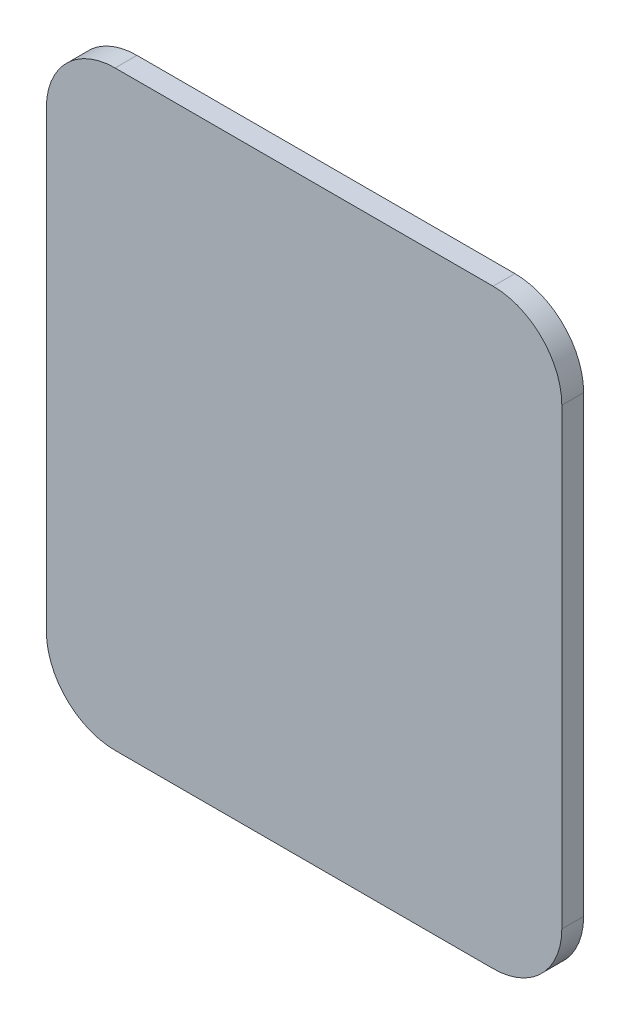
ISO-10303-21;
HEADER;
FILE_DESCRIPTION(('STEP AP214'),'2;1');
FILE_NAME('part.step','',(''),(''),'','','');
FILE_SCHEMA(('AUTOMOTIVE_DESIGN { 1 0 10303 214 1 1 1 1 }'));
ENDSEC;
DATA;
#1=APPLICATION_CONTEXT('core data for automotive mechanical design processes');
#2=APPLICATION_PROTOCOL_DEFINITION('international standard','automotive_design',2000,#1);
#3=PRODUCT_CONTEXT('',#1,'mechanical');
#4=PRODUCT('Part','Part','',(#3));
#5=PRODUCT_RELATED_PRODUCT_CATEGORY('part','',(#4));
#6=PRODUCT_DEFINITION_FORMATION('','',#4);
#7=PRODUCT_DEFINITION_CONTEXT('part definition',#1,'design');
#8=PRODUCT_DEFINITION('design','',#6,#7);
#9=PRODUCT_DEFINITION_SHAPE('','',#8);
#10=(LENGTH_UNIT() NAMED_UNIT(*) SI_UNIT(.MILLI.,.METRE.));
#11=(NAMED_UNIT(*) PLANE_ANGLE_UNIT() SI_UNIT($,.RADIAN.));
#12=(NAMED_UNIT(*) SI_UNIT($,.STERADIAN.) SOLID_ANGLE_UNIT());
#13=UNCERTAINTY_MEASURE_WITH_UNIT(LENGTH_MEASURE(1.E-05),#10,'distance_accuracy_value','');
#14=(GEOMETRIC_REPRESENTATION_CONTEXT(3) GLOBAL_UNCERTAINTY_ASSIGNED_CONTEXT((#13)) GLOBAL_UNIT_ASSIGNED_CONTEXT((#10,
#11,#12)) REPRESENTATION_CONTEXT('',''));
#15=CARTESIAN_POINT('',(0.,0.,0.));
#16=DIRECTION('',(0.,0.,1.));
#17=DIRECTION('',(1.,0.,0.));
#18=AXIS2_PLACEMENT_3D('',#15,#16,#17);
#19=CARTESIAN_POINT('',(55.,152.,6.35));
#20=DIRECTION('',(0.,0.,-1.));
#21=DIRECTION('',(-1.,0.,0.));
#22=AXIS2_PLACEMENT_3D('',#19,#20,#21);
#23=CYLINDRICAL_SURFACE('',#22,20.);
#24=CARTESIAN_POINT('',(55.,152.,0.));
#25=DIRECTION('',(0.,0.,1.));
#26=DIRECTION('',(1.,0.,0.));
#27=AXIS2_PLACEMENT_3D('',#24,#25,#26);
#28=CIRCLE('',#27,20.);
#29=CARTESIAN_POINT('',(74.9999999999999,152.,0.));
#30=VERTEX_POINT('',#29);
#31=CARTESIAN_POINT('',(54.9999999999998,172.,0.));
#32=VERTEX_POINT('',#31);
#33=EDGE_CURVE('E134',#30,#32,#28,.T.);
#34=ORIENTED_EDGE('',*,*,#33,.T.);
#35=DIRECTION('',(0.,0.,-1.));
#36=VECTOR('',#35,1.);
#37=CARTESIAN_POINT('',(54.9999999999998,172.,6.35));
#38=LINE('',#37,#36);
#39=CARTESIAN_POINT('',(54.9999999999998,172.,6.35));
#40=VERTEX_POINT('',#39);
#41=EDGE_CURVE('E11',#40,#32,#38,.T.);
#42=ORIENTED_EDGE('',*,*,#41,.F.);
#43=CARTESIAN_POINT('',(55.,152.,6.35));
#44=DIRECTION('',(0.,0.,1.));
#45=DIRECTION('',(1.,0.,0.));
#46=AXIS2_PLACEMENT_3D('',#43,#44,#45);
#47=CIRCLE('',#46,20.);
#48=CARTESIAN_POINT('',(74.9999999999999,152.,6.35));
#49=VERTEX_POINT('',#48);
#50=EDGE_CURVE('E148',#49,#40,#47,.T.);
#51=ORIENTED_EDGE('',*,*,#50,.F.);
#52=DIRECTION('',(0.,0.,-1.));
#53=VECTOR('',#52,1.);
#54=CARTESIAN_POINT('',(74.9999999999999,152.,6.35));
#55=LINE('',#54,#53);
#56=EDGE_CURVE('E130',#49,#30,#55,.T.);
#57=ORIENTED_EDGE('',*,*,#56,.T.);
#58=EDGE_LOOP('',(#34,#42,#51,#57));
#59=FACE_BOUND('',#58,.T.);
#60=ADVANCED_FACE('F38',(#59),#23,.T.);
#61=CARTESIAN_POINT('',(-54.9999999999999,172.,6.35));
#62=DIRECTION('',(0.,-1.,0.));
#63=DIRECTION('',(1.,0.,0.));
#64=AXIS2_PLACEMENT_3D('',#61,#62,#63);
#65=PLANE('',#64);
#66=DIRECTION('',(-1.,0.,0.));
#67=VECTOR('',#66,1.);
#68=CARTESIAN_POINT('',(-54.9999999999999,172.,0.));
#69=LINE('',#68,#67);
#70=CARTESIAN_POINT('',(-54.9999999999999,172.,0.));
#71=VERTEX_POINT('',#70);
#72=EDGE_CURVE('E137',#32,#71,#69,.T.);
#73=ORIENTED_EDGE('',*,*,#72,.T.);
#74=DIRECTION('',(0.,0.,-1.));
#75=VECTOR('',#74,1.);
#76=CARTESIAN_POINT('',(-54.9999999999999,172.,6.35));
#77=LINE('',#76,#75);
#78=CARTESIAN_POINT('',(-54.9999999999999,172.,6.35));
#79=VERTEX_POINT('',#78);
#80=EDGE_CURVE('E46',#79,#71,#77,.T.);
#81=ORIENTED_EDGE('',*,*,#80,.F.);
#82=DIRECTION('',(-1.,0.,0.));
#83=VECTOR('',#82,1.);
#84=CARTESIAN_POINT('',(-54.9999999999999,172.,6.35));
#85=LINE('',#84,#83);
#86=EDGE_CURVE('E97',#40,#79,#85,.T.);
#87=ORIENTED_EDGE('',*,*,#86,.F.);
#88=ORIENTED_EDGE('',*,*,#41,.T.);
#89=EDGE_LOOP('',(#73,#81,#87,#88));
#90=FACE_BOUND('',#89,.T.);
#91=ADVANCED_FACE('F183',(#90),#65,.F.);
#92=CARTESIAN_POINT('',(-55.,152.,6.35));
#93=DIRECTION('',(0.,0.,-1.));
#94=DIRECTION('',(-1.,0.,0.));
#95=AXIS2_PLACEMENT_3D('',#92,#93,#94);
#96=CYLINDRICAL_SURFACE('',#95,20.);
#97=CARTESIAN_POINT('',(-55.,152.,0.));
#98=DIRECTION('',(0.,0.,1.));
#99=DIRECTION('',(1.,0.,0.));
#100=AXIS2_PLACEMENT_3D('',#97,#98,#99);
#101=CIRCLE('',#100,20.);
#102=CARTESIAN_POINT('',(-75.,152.,0.));
#103=VERTEX_POINT('',#102);
#104=EDGE_CURVE('E139',#71,#103,#101,.T.);
#105=ORIENTED_EDGE('',*,*,#104,.T.);
#106=DIRECTION('',(0.,0.,-1.));
#107=VECTOR('',#106,1.);
#108=CARTESIAN_POINT('',(-75.,152.,6.35));
#109=LINE('',#108,#107);
#110=CARTESIAN_POINT('',(-75.,152.,6.35));
#111=VERTEX_POINT('',#110);
#112=EDGE_CURVE('E155',#111,#103,#109,.T.);
#113=ORIENTED_EDGE('',*,*,#112,.F.);
#114=CARTESIAN_POINT('',(-55.,152.,6.35));
#115=DIRECTION('',(0.,0.,1.));
#116=DIRECTION('',(1.,0.,0.));
#117=AXIS2_PLACEMENT_3D('',#114,#115,#116);
#118=CIRCLE('',#117,20.);
#119=EDGE_CURVE('E163',#79,#111,#118,.T.);
#120=ORIENTED_EDGE('',*,*,#119,.F.);
#121=ORIENTED_EDGE('',*,*,#80,.T.);
#122=EDGE_LOOP('',(#105,#113,#120,#121));
#123=FACE_BOUND('',#122,.T.);
#124=ADVANCED_FACE('F161',(#123),#96,.T.);
#125=CARTESIAN_POINT('',(-75.,20.0000000000001,6.35));
#126=DIRECTION('',(1.,0.,0.));
#127=DIRECTION('',(0.,0.,-1.));
#128=AXIS2_PLACEMENT_3D('',#125,#126,#127);
#129=PLANE('',#128);
#130=DIRECTION('',(0.,-1.,0.));
#131=VECTOR('',#130,1.);
#132=CARTESIAN_POINT('',(-75.,20.0000000000001,0.));
#133=LINE('',#132,#131);
#134=CARTESIAN_POINT('',(-75.,20.0000000000001,0.));
#135=VERTEX_POINT('',#134);
#136=EDGE_CURVE('E141',#103,#135,#133,.T.);
#137=ORIENTED_EDGE('',*,*,#136,.T.);
#138=DIRECTION('',(0.,0.,-1.));
#139=VECTOR('',#138,1.);
#140=CARTESIAN_POINT('',(-75.,20.0000000000001,6.35));
#141=LINE('',#140,#139);
#142=CARTESIAN_POINT('',(-75.,20.0000000000001,6.35));
#143=VERTEX_POINT('',#142);
#144=EDGE_CURVE('E152',#143,#135,#141,.T.);
#145=ORIENTED_EDGE('',*,*,#144,.F.);
#146=DIRECTION('',(0.,-1.,0.));
#147=VECTOR('',#146,1.);
#148=CARTESIAN_POINT('',(-75.,20.0000000000001,6.35));
#149=LINE('',#148,#147);
#150=EDGE_CURVE('E175',#111,#143,#149,.T.);
#151=ORIENTED_EDGE('',*,*,#150,.F.);
#152=ORIENTED_EDGE('',*,*,#112,.T.);
#153=EDGE_LOOP('',(#137,#145,#151,#152));
#154=FACE_BOUND('',#153,.T.);
#155=ADVANCED_FACE('F171',(#154),#129,.F.);
#156=CARTESIAN_POINT('',(-55.,20.,6.35));
#157=DIRECTION('',(0.,0.,-1.));
#158=DIRECTION('',(-1.,0.,0.));
#159=AXIS2_PLACEMENT_3D('',#156,#157,#158);
#160=CYLINDRICAL_SURFACE('',#159,20.);
#161=CARTESIAN_POINT('',(-55.,20.,0.));
#162=DIRECTION('',(0.,0.,1.));
#163=DIRECTION('',(1.,0.,0.));
#164=AXIS2_PLACEMENT_3D('',#161,#162,#163);
#165=CIRCLE('',#164,20.);
#166=CARTESIAN_POINT('',(-54.9999999999999,0.,0.));
#167=VERTEX_POINT('',#166);
#168=EDGE_CURVE('E143',#135,#167,#165,.T.);
#169=ORIENTED_EDGE('',*,*,#168,.T.);
#170=DIRECTION('',(0.,0.,-1.));
#171=VECTOR('',#170,1.);
#172=CARTESIAN_POINT('',(-54.9999999999999,0.,6.35));
#173=LINE('',#172,#171);
#174=CARTESIAN_POINT('',(-54.9999999999999,0.,6.35));
#175=VERTEX_POINT('',#174);
#176=EDGE_CURVE('E125',#175,#167,#173,.T.);
#177=ORIENTED_EDGE('',*,*,#176,.F.);
#178=CARTESIAN_POINT('',(-55.,20.,6.35));
#179=DIRECTION('',(0.,0.,1.));
#180=DIRECTION('',(1.,0.,0.));
#181=AXIS2_PLACEMENT_3D('',#178,#179,#180);
#182=CIRCLE('',#181,20.);
#183=EDGE_CURVE('E116',#143,#175,#182,.T.);
#184=ORIENTED_EDGE('',*,*,#183,.F.);
#185=ORIENTED_EDGE('',*,*,#144,.T.);
#186=EDGE_LOOP('',(#169,#177,#184,#185));
#187=FACE_BOUND('',#186,.T.);
#188=ADVANCED_FACE('F174',(#187),#160,.T.);
#189=CARTESIAN_POINT('',(-54.9999999999999,0.,6.35));
#190=DIRECTION('',(0.,1.,0.));
#191=DIRECTION('',(-1.,0.,0.));
#192=AXIS2_PLACEMENT_3D('',#189,#190,#191);
#193=PLANE('',#192);
#194=DIRECTION('',(1.,0.,0.));
#195=VECTOR('',#194,1.);
#196=CARTESIAN_POINT('',(-54.9999999999999,0.,0.));
#197=LINE('',#196,#195);
#198=CARTESIAN_POINT('',(54.9999999999999,0.,0.));
#199=VERTEX_POINT('',#198);
#200=EDGE_CURVE('E124',#167,#199,#197,.T.);
#201=ORIENTED_EDGE('',*,*,#200,.T.);
#202=DIRECTION('',(0.,0.,-1.));
#203=VECTOR('',#202,1.);
#204=CARTESIAN_POINT('',(54.9999999999999,0.,6.35));
#205=LINE('',#204,#203);
#206=CARTESIAN_POINT('',(54.9999999999999,0.,6.35));
#207=VERTEX_POINT('',#206);
#208=EDGE_CURVE('E121',#207,#199,#205,.T.);
#209=ORIENTED_EDGE('',*,*,#208,.F.);
#210=DIRECTION('',(1.,0.,0.));
#211=VECTOR('',#210,1.);
#212=CARTESIAN_POINT('',(-54.9999999999999,0.,6.35));
#213=LINE('',#212,#211);
#214=EDGE_CURVE('E110',#175,#207,#213,.T.);
#215=ORIENTED_EDGE('',*,*,#214,.F.);
#216=ORIENTED_EDGE('',*,*,#176,.T.);
#217=EDGE_LOOP('',(#201,#209,#215,#216));
#218=FACE_BOUND('',#217,.T.);
#219=ADVANCED_FACE('F122',(#218),#193,.F.);
#220=CARTESIAN_POINT('',(55.,20.,6.35));
#221=DIRECTION('',(0.,0.,-1.));
#222=DIRECTION('',(-1.,0.,0.));
#223=AXIS2_PLACEMENT_3D('',#220,#221,#222);
#224=CYLINDRICAL_SURFACE('',#223,20.);
#225=CARTESIAN_POINT('',(55.,20.,0.));
#226=DIRECTION('',(0.,0.,1.));
#227=DIRECTION('',(1.,0.,0.));
#228=AXIS2_PLACEMENT_3D('',#225,#226,#227);
#229=CIRCLE('',#228,20.);
#230=CARTESIAN_POINT('',(75.,20.0000000000002,0.));
#231=VERTEX_POINT('',#230);
#232=EDGE_CURVE('E83',#199,#231,#229,.T.);
#233=ORIENTED_EDGE('',*,*,#232,.T.);
#234=DIRECTION('',(0.,0.,-1.));
#235=VECTOR('',#234,1.);
#236=CARTESIAN_POINT('',(75.,20.0000000000002,6.35));
#237=LINE('',#236,#235);
#238=CARTESIAN_POINT('',(75.,20.0000000000002,6.35));
#239=VERTEX_POINT('',#238);
#240=EDGE_CURVE('E126',#239,#231,#237,.T.);
#241=ORIENTED_EDGE('',*,*,#240,.F.);
#242=CARTESIAN_POINT('',(55.,20.,6.35));
#243=DIRECTION('',(0.,0.,1.));
#244=DIRECTION('',(1.,0.,0.));
#245=AXIS2_PLACEMENT_3D('',#242,#243,#244);
#246=CIRCLE('',#245,20.);
#247=EDGE_CURVE('E114',#207,#239,#246,.T.);
#248=ORIENTED_EDGE('',*,*,#247,.F.);
#249=ORIENTED_EDGE('',*,*,#208,.T.);
#250=EDGE_LOOP('',(#233,#241,#248,#249));
#251=FACE_BOUND('',#250,.T.);
#252=ADVANCED_FACE('F128',(#251),#224,.T.);
#253=CARTESIAN_POINT('',(75.,20.0000000000002,6.35));
#254=DIRECTION('',(-1.,0.,0.));
#255=DIRECTION('',(0.,-1.,0.));
#256=AXIS2_PLACEMENT_3D('',#253,#254,#255);
#257=PLANE('',#256);
#258=DIRECTION('',(0.,1.,0.));
#259=VECTOR('',#258,1.);
#260=CARTESIAN_POINT('',(75.,20.0000000000002,0.));
#261=LINE('',#260,#259);
#262=EDGE_CURVE('E89',#231,#30,#261,.T.);
#263=ORIENTED_EDGE('',*,*,#262,.T.);
#264=ORIENTED_EDGE('',*,*,#56,.F.);
#265=DIRECTION('',(0.,1.,0.));
#266=VECTOR('',#265,1.);
#267=CARTESIAN_POINT('',(75.,20.0000000000002,6.35));
#268=LINE('',#267,#266);
#269=EDGE_CURVE('E54',#239,#49,#268,.T.);
#270=ORIENTED_EDGE('',*,*,#269,.F.);
#271=ORIENTED_EDGE('',*,*,#240,.T.);
#272=EDGE_LOOP('',(#263,#264,#270,#271));
#273=FACE_BOUND('',#272,.T.);
#274=ADVANCED_FACE('F199',(#273),#257,.F.);
#275=CARTESIAN_POINT('',(55.,152.,6.35));
#276=DIRECTION('',(0.,0.,1.));
#277=DIRECTION('',(1.,0.,0.));
#278=AXIS2_PLACEMENT_3D('',#275,#276,#277);
#279=PLANE('',#278);
#280=ORIENTED_EDGE('',*,*,#50,.T.);
#281=ORIENTED_EDGE('',*,*,#86,.T.);
#282=ORIENTED_EDGE('',*,*,#119,.T.);
#283=ORIENTED_EDGE('',*,*,#150,.T.);
#284=ORIENTED_EDGE('',*,*,#183,.T.);
#285=ORIENTED_EDGE('',*,*,#214,.T.);
#286=ORIENTED_EDGE('',*,*,#247,.T.);
#287=ORIENTED_EDGE('',*,*,#269,.T.);
#288=EDGE_LOOP('',(#280,#281,#282,#283,#284,#285,#286,#287));
#289=FACE_BOUND('',#288,.T.);
#290=ADVANCED_FACE('F112',(#289),#279,.T.);
#291=CARTESIAN_POINT('',(55.,152.,0.));
#292=DIRECTION('',(0.,0.,1.));
#293=DIRECTION('',(1.,0.,0.));
#294=AXIS2_PLACEMENT_3D('',#291,#292,#293);
#295=PLANE('',#294);
#296=ORIENTED_EDGE('',*,*,#33,.F.);
#297=ORIENTED_EDGE('',*,*,#262,.F.);
#298=ORIENTED_EDGE('',*,*,#232,.F.);
#299=ORIENTED_EDGE('',*,*,#200,.F.);
#300=ORIENTED_EDGE('',*,*,#168,.F.);
#301=ORIENTED_EDGE('',*,*,#136,.F.);
#302=ORIENTED_EDGE('',*,*,#104,.F.);
#303=ORIENTED_EDGE('',*,*,#72,.F.);
#304=EDGE_LOOP('',(#296,#297,#298,#299,#300,#301,#302,#303));
#305=FACE_BOUND('',#304,.T.);
#306=ADVANCED_FACE('F167',(#305),#295,.F.);
#307=CLOSED_SHELL('',(#60,#91,#124,#155,#188,#219,#252,#274,#290,#306));
#308=MANIFOLD_SOLID_BREP('B2',#307);
#309=ADVANCED_BREP_SHAPE_REPRESENTATION('',(#18,#308),#14);
#310=SHAPE_DEFINITION_REPRESENTATION(#9,#309);
ENDSEC;
END-ISO-10303-21;
